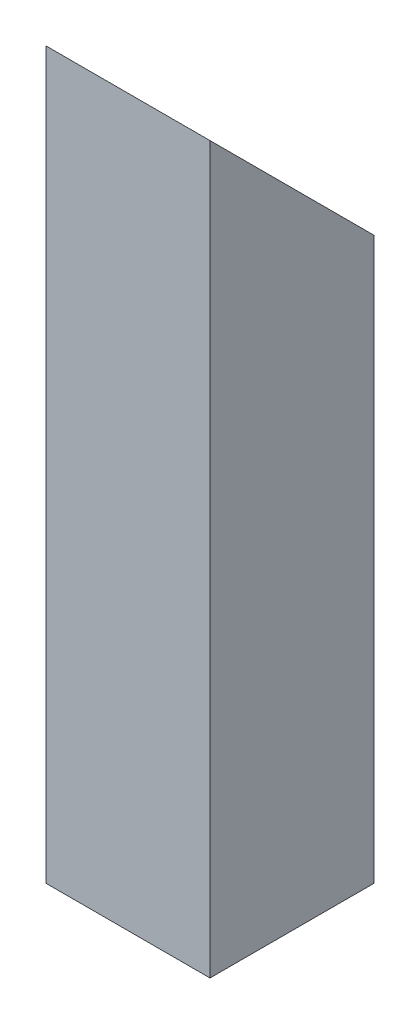
ISO-10303-21;
HEADER;
FILE_DESCRIPTION(('STEP AP214'),'2;1');
FILE_NAME('part.step','',(''),(''),'','','');
FILE_SCHEMA(('AUTOMOTIVE_DESIGN { 1 0 10303 214 1 1 1 1 }'));
ENDSEC;
DATA;
#1=APPLICATION_CONTEXT('core data for automotive mechanical design processes');
#2=APPLICATION_PROTOCOL_DEFINITION('international standard','automotive_design',2000,#1);
#3=PRODUCT_CONTEXT('',#1,'mechanical');
#4=PRODUCT('Part','Part','',(#3));
#5=PRODUCT_RELATED_PRODUCT_CATEGORY('part','',(#4));
#6=PRODUCT_DEFINITION_FORMATION('','',#4);
#7=PRODUCT_DEFINITION_CONTEXT('part definition',#1,'design');
#8=PRODUCT_DEFINITION('design','',#6,#7);
#9=PRODUCT_DEFINITION_SHAPE('','',#8);
#10=(LENGTH_UNIT() NAMED_UNIT(*) SI_UNIT(.MILLI.,.METRE.));
#11=(NAMED_UNIT(*) PLANE_ANGLE_UNIT() SI_UNIT($,.RADIAN.));
#12=(NAMED_UNIT(*) SI_UNIT($,.STERADIAN.) SOLID_ANGLE_UNIT());
#13=UNCERTAINTY_MEASURE_WITH_UNIT(LENGTH_MEASURE(1.E-05),#10,'distance_accuracy_value','');
#14=(GEOMETRIC_REPRESENTATION_CONTEXT(3) GLOBAL_UNCERTAINTY_ASSIGNED_CONTEXT((#13)) GLOBAL_UNIT_ASSIGNED_CONTEXT((#10,
#11,#12)) REPRESENTATION_CONTEXT('',''));
#15=CARTESIAN_POINT('',(0.,0.,0.));
#16=DIRECTION('',(0.,0.,1.));
#17=DIRECTION('',(1.,0.,0.));
#18=AXIS2_PLACEMENT_3D('',#15,#16,#17);
#19=CARTESIAN_POINT('',(44.45,0.,-44.45));
#20=DIRECTION('',(0.,0.,-1.));
#21=DIRECTION('',(-1.,0.,0.));
#22=AXIS2_PLACEMENT_3D('',#19,#20,#21);
#23=PLANE('',#22);
#24=DIRECTION('',(0.,1.,0.));
#25=VECTOR('',#24,1.);
#26=CARTESIAN_POINT('',(0.,0.,-44.45));
#27=LINE('',#26,#25);
#28=CARTESIAN_POINT('',(0.,152.4,-44.45));
#29=VERTEX_POINT('',#28);
#30=CARTESIAN_POINT('',(0.,0.,-44.45));
#31=VERTEX_POINT('',#30);
#32=EDGE_CURVE('E89',#29,#31,#27,.F.);
#33=ORIENTED_EDGE('',*,*,#32,.F.);
#34=DIRECTION('',(1.,0.,0.));
#35=VECTOR('',#34,1.);
#36=CARTESIAN_POINT('',(22.225,152.4,-44.45));
#37=LINE('',#36,#35);
#38=CARTESIAN_POINT('',(44.45,152.4,-44.45));
#39=VERTEX_POINT('',#38);
#40=EDGE_CURVE('E134',#39,#29,#37,.F.);
#41=ORIENTED_EDGE('',*,*,#40,.F.);
#42=DIRECTION('',(0.,1.,0.));
#43=VECTOR('',#42,1.);
#44=CARTESIAN_POINT('',(44.45,0.,-44.45));
#45=LINE('',#44,#43);
#46=CARTESIAN_POINT('',(44.45,0.,-44.45));
#47=VERTEX_POINT('',#46);
#48=EDGE_CURVE('E141',#47,#39,#45,.T.);
#49=ORIENTED_EDGE('',*,*,#48,.F.);
#50=DIRECTION('',(1.,0.,0.));
#51=VECTOR('',#50,1.);
#52=CARTESIAN_POINT('',(0.,0.,-44.45));
#53=LINE('',#52,#51);
#54=EDGE_CURVE('E110',#47,#31,#53,.F.);
#55=ORIENTED_EDGE('',*,*,#54,.T.);
#56=EDGE_LOOP('',(#33,#41,#49,#55));
#57=FACE_BOUND('',#56,.T.);
#58=ADVANCED_FACE('F17',(#57),#23,.T.);
#59=CARTESIAN_POINT('',(41.275,0.,-41.275));
#60=DIRECTION('',(-1.,0.,0.));
#61=DIRECTION('',(0.,0.,1.));
#62=AXIS2_PLACEMENT_3D('',#59,#60,#61);
#63=PLANE('',#62);
#64=DIRECTION('',(0.,1.,0.));
#65=VECTOR('',#64,1.);
#66=CARTESIAN_POINT('',(41.275,0.,-3.175));
#67=LINE('',#66,#65);
#68=CARTESIAN_POINT('',(41.275,193.675,-3.17499999999998));
#69=VERTEX_POINT('',#68);
#70=CARTESIAN_POINT('',(41.275,0.,-3.175));
#71=VERTEX_POINT('',#70);
#72=EDGE_CURVE('E20',#69,#71,#67,.F.);
#73=ORIENTED_EDGE('',*,*,#72,.F.);
#74=DIRECTION('',(0.,0.707106781186548,0.707106781186548));
#75=VECTOR('',#74,1.);
#76=CARTESIAN_POINT('',(41.275,174.625,-22.225));
#77=LINE('',#76,#75);
#78=CARTESIAN_POINT('',(41.275,155.575,-41.275));
#79=VERTEX_POINT('',#78);
#80=EDGE_CURVE('E85',#79,#69,#77,.T.);
#81=ORIENTED_EDGE('',*,*,#80,.F.);
#82=DIRECTION('',(0.,1.,0.));
#83=VECTOR('',#82,1.);
#84=CARTESIAN_POINT('',(41.275,0.,-41.275));
#85=LINE('',#84,#83);
#86=CARTESIAN_POINT('',(41.275,0.,-41.275));
#87=VERTEX_POINT('',#86);
#88=EDGE_CURVE('E78',#87,#79,#85,.T.);
#89=ORIENTED_EDGE('',*,*,#88,.F.);
#90=DIRECTION('',(0.,0.,1.));
#91=VECTOR('',#90,1.);
#92=CARTESIAN_POINT('',(41.275,0.,0.));
#93=LINE('',#92,#91);
#94=EDGE_CURVE('E82',#87,#71,#93,.T.);
#95=ORIENTED_EDGE('',*,*,#94,.T.);
#96=EDGE_LOOP('',(#73,#81,#89,#95));
#97=FACE_BOUND('',#96,.T.);
#98=ADVANCED_FACE('F80',(#97),#63,.T.);
#99=CARTESIAN_POINT('',(41.275,0.,-3.175));
#100=DIRECTION('',(0.,0.,-1.));
#101=DIRECTION('',(-1.,0.,0.));
#102=AXIS2_PLACEMENT_3D('',#99,#100,#101);
#103=PLANE('',#102);
#104=DIRECTION('',(0.,1.,0.));
#105=VECTOR('',#104,1.);
#106=CARTESIAN_POINT('',(3.175,0.,-3.175));
#107=LINE('',#106,#105);
#108=CARTESIAN_POINT('',(3.175,193.675,-3.17499999999999));
#109=VERTEX_POINT('',#108);
#110=CARTESIAN_POINT('',(3.175,0.,-3.175));
#111=VERTEX_POINT('',#110);
#112=EDGE_CURVE('E115',#109,#111,#107,.F.);
#113=ORIENTED_EDGE('',*,*,#112,.F.);
#114=DIRECTION('',(1.,0.,0.));
#115=VECTOR('',#114,1.);
#116=CARTESIAN_POINT('',(22.225,193.675,-3.17500000000001));
#117=LINE('',#116,#115);
#118=EDGE_CURVE('E123',#69,#109,#117,.F.);
#119=ORIENTED_EDGE('',*,*,#118,.F.);
#120=ORIENTED_EDGE('',*,*,#72,.T.);
#121=DIRECTION('',(1.,0.,0.));
#122=VECTOR('',#121,1.);
#123=CARTESIAN_POINT('',(0.,0.,-3.175));
#124=LINE('',#123,#122);
#125=EDGE_CURVE('E103',#71,#111,#124,.F.);
#126=ORIENTED_EDGE('',*,*,#125,.T.);
#127=EDGE_LOOP('',(#113,#119,#120,#126));
#128=FACE_BOUND('',#127,.T.);
#129=ADVANCED_FACE('F121',(#128),#103,.T.);
#130=CARTESIAN_POINT('',(3.175,0.,-3.175));
#131=DIRECTION('',(1.,0.,0.));
#132=DIRECTION('',(0.,0.,-1.));
#133=AXIS2_PLACEMENT_3D('',#130,#131,#132);
#134=PLANE('',#133);
#135=DIRECTION('',(0.,1.,0.));
#136=VECTOR('',#135,1.);
#137=CARTESIAN_POINT('',(3.175,0.,-41.275));
#138=LINE('',#137,#136);
#139=CARTESIAN_POINT('',(3.175,155.575,-41.275));
#140=VERTEX_POINT('',#139);
#141=CARTESIAN_POINT('',(3.175,0.,-41.275));
#142=VERTEX_POINT('',#141);
#143=EDGE_CURVE('E90',#140,#142,#138,.F.);
#144=ORIENTED_EDGE('',*,*,#143,.F.);
#145=DIRECTION('',(0.,0.707106781186548,0.707106781186548));
#146=VECTOR('',#145,1.);
#147=CARTESIAN_POINT('',(3.17499999999999,174.625,-22.225));
#148=LINE('',#147,#146);
#149=EDGE_CURVE('E126',#109,#140,#148,.F.);
#150=ORIENTED_EDGE('',*,*,#149,.F.);
#151=ORIENTED_EDGE('',*,*,#112,.T.);
#152=DIRECTION('',(0.,0.,1.));
#153=VECTOR('',#152,1.);
#154=CARTESIAN_POINT('',(3.175,0.,0.));
#155=LINE('',#154,#153);
#156=EDGE_CURVE('E105',#111,#142,#155,.F.);
#157=ORIENTED_EDGE('',*,*,#156,.T.);
#158=EDGE_LOOP('',(#144,#150,#151,#157));
#159=FACE_BOUND('',#158,.T.);
#160=ADVANCED_FACE('F145',(#159),#134,.T.);
#161=CARTESIAN_POINT('',(3.175,0.,-41.275));
#162=DIRECTION('',(0.,0.,1.));
#163=DIRECTION('',(1.,0.,0.));
#164=AXIS2_PLACEMENT_3D('',#161,#162,#163);
#165=PLANE('',#164);
#166=ORIENTED_EDGE('',*,*,#88,.T.);
#167=DIRECTION('',(1.,0.,0.));
#168=VECTOR('',#167,1.);
#169=CARTESIAN_POINT('',(22.225,155.575,-41.275));
#170=LINE('',#169,#168);
#171=EDGE_CURVE('E130',#140,#79,#170,.T.);
#172=ORIENTED_EDGE('',*,*,#171,.F.);
#173=ORIENTED_EDGE('',*,*,#143,.T.);
#174=DIRECTION('',(1.,0.,0.));
#175=VECTOR('',#174,1.);
#176=CARTESIAN_POINT('',(0.,0.,-41.275));
#177=LINE('',#176,#175);
#178=EDGE_CURVE('E93',#142,#87,#177,.T.);
#179=ORIENTED_EDGE('',*,*,#178,.T.);
#180=EDGE_LOOP('',(#166,#172,#173,#179));
#181=FACE_BOUND('',#180,.T.);
#182=ADVANCED_FACE('F94',(#181),#165,.T.);
#183=CARTESIAN_POINT('',(0.,0.,-44.45));
#184=DIRECTION('',(-1.,0.,0.));
#185=DIRECTION('',(0.,0.,1.));
#186=AXIS2_PLACEMENT_3D('',#183,#184,#185);
#187=PLANE('',#186);
#188=DIRECTION('',(0.,1.,0.));
#189=VECTOR('',#188,1.);
#190=CARTESIAN_POINT('',(0.,0.,0.));
#191=LINE('',#190,#189);
#192=CARTESIAN_POINT('',(0.,196.85,0.));
#193=VERTEX_POINT('',#192);
#194=CARTESIAN_POINT('',(0.,0.,0.));
#195=VERTEX_POINT('',#194);
#196=EDGE_CURVE('E146',#193,#195,#191,.F.);
#197=ORIENTED_EDGE('',*,*,#196,.F.);
#198=DIRECTION('',(0.,0.707106781186548,0.707106781186548));
#199=VECTOR('',#198,1.);
#200=CARTESIAN_POINT('',(0.,174.625,-22.225));
#201=LINE('',#200,#199);
#202=EDGE_CURVE('E131',#29,#193,#201,.T.);
#203=ORIENTED_EDGE('',*,*,#202,.F.);
#204=ORIENTED_EDGE('',*,*,#32,.T.);
#205=DIRECTION('',(0.,0.,1.));
#206=VECTOR('',#205,1.);
#207=CARTESIAN_POINT('',(0.,0.,0.));
#208=LINE('',#207,#206);
#209=EDGE_CURVE('E98',#31,#195,#208,.T.);
#210=ORIENTED_EDGE('',*,*,#209,.T.);
#211=EDGE_LOOP('',(#197,#203,#204,#210));
#212=FACE_BOUND('',#211,.T.);
#213=ADVANCED_FACE('F165',(#212),#187,.T.);
#214=CARTESIAN_POINT('',(0.,0.,0.));
#215=DIRECTION('',(0.,1.,0.));
#216=DIRECTION('',(0.,0.,1.));
#217=AXIS2_PLACEMENT_3D('',#214,#215,#216);
#218=PLANE('',#217);
#219=ORIENTED_EDGE('',*,*,#125,.F.);
#220=ORIENTED_EDGE('',*,*,#94,.F.);
#221=ORIENTED_EDGE('',*,*,#178,.F.);
#222=ORIENTED_EDGE('',*,*,#156,.F.);
#223=EDGE_LOOP('',(#219,#220,#221,#222));
#224=FACE_BOUND('',#223,.T.);
#225=ORIENTED_EDGE('',*,*,#54,.F.);
#226=DIRECTION('',(0.,0.,-1.));
#227=VECTOR('',#226,1.);
#228=CARTESIAN_POINT('',(44.45,0.,0.));
#229=LINE('',#228,#227);
#230=CARTESIAN_POINT('',(44.45,0.,0.));
#231=VERTEX_POINT('',#230);
#232=EDGE_CURVE('E143',#231,#47,#229,.T.);
#233=ORIENTED_EDGE('',*,*,#232,.F.);
#234=DIRECTION('',(1.,0.,0.));
#235=VECTOR('',#234,1.);
#236=CARTESIAN_POINT('',(0.,0.,0.));
#237=LINE('',#236,#235);
#238=EDGE_CURVE('E151',#195,#231,#237,.T.);
#239=ORIENTED_EDGE('',*,*,#238,.F.);
#240=ORIENTED_EDGE('',*,*,#209,.F.);
#241=EDGE_LOOP('',(#225,#233,#239,#240));
#242=FACE_BOUND('',#241,.T.);
#243=ADVANCED_FACE('F101',(#224,#242),#218,.F.);
#244=CARTESIAN_POINT('',(44.45,0.,0.));
#245=DIRECTION('',(1.,0.,0.));
#246=DIRECTION('',(0.,0.,-1.));
#247=AXIS2_PLACEMENT_3D('',#244,#245,#246);
#248=PLANE('',#247);
#249=ORIENTED_EDGE('',*,*,#48,.T.);
#250=DIRECTION('',(0.,0.707106781186548,0.707106781186548));
#251=VECTOR('',#250,1.);
#252=CARTESIAN_POINT('',(44.45,174.625,-22.225));
#253=LINE('',#252,#251);
#254=CARTESIAN_POINT('',(44.45,196.85,0.));
#255=VERTEX_POINT('',#254);
#256=EDGE_CURVE('E35',#255,#39,#253,.F.);
#257=ORIENTED_EDGE('',*,*,#256,.F.);
#258=DIRECTION('',(0.,1.,0.));
#259=VECTOR('',#258,1.);
#260=CARTESIAN_POINT('',(44.45,0.,0.));
#261=LINE('',#260,#259);
#262=EDGE_CURVE('E26',#231,#255,#261,.T.);
#263=ORIENTED_EDGE('',*,*,#262,.F.);
#264=ORIENTED_EDGE('',*,*,#232,.T.);
#265=EDGE_LOOP('',(#249,#257,#263,#264));
#266=FACE_BOUND('',#265,.T.);
#267=ADVANCED_FACE('F158',(#266),#248,.T.);
#268=CARTESIAN_POINT('',(22.225,174.625,-22.225));
#269=DIRECTION('',(0.,0.707106781186548,-0.707106781186548));
#270=DIRECTION('',(0.,0.707106781186548,0.707106781186548));
#271=AXIS2_PLACEMENT_3D('',#268,#269,#270);
#272=PLANE('',#271);
#273=ORIENTED_EDGE('',*,*,#149,.T.);
#274=ORIENTED_EDGE('',*,*,#171,.T.);
#275=ORIENTED_EDGE('',*,*,#80,.T.);
#276=ORIENTED_EDGE('',*,*,#118,.T.);
#277=EDGE_LOOP('',(#273,#274,#275,#276));
#278=FACE_BOUND('',#277,.T.);
#279=ORIENTED_EDGE('',*,*,#40,.T.);
#280=ORIENTED_EDGE('',*,*,#202,.T.);
#281=DIRECTION('',(1.,0.,0.));
#282=VECTOR('',#281,1.);
#283=CARTESIAN_POINT('',(0.,196.85,0.));
#284=LINE('',#283,#282);
#285=EDGE_CURVE('E11',#255,#193,#284,.F.);
#286=ORIENTED_EDGE('',*,*,#285,.F.);
#287=ORIENTED_EDGE('',*,*,#256,.T.);
#288=EDGE_LOOP('',(#279,#280,#286,#287));
#289=FACE_BOUND('',#288,.T.);
#290=ADVANCED_FACE('F128',(#278,#289),#272,.T.);
#291=CARTESIAN_POINT('',(0.,0.,0.));
#292=DIRECTION('',(0.,0.,1.));
#293=DIRECTION('',(1.,0.,0.));
#294=AXIS2_PLACEMENT_3D('',#291,#292,#293);
#295=PLANE('',#294);
#296=ORIENTED_EDGE('',*,*,#262,.T.);
#297=ORIENTED_EDGE('',*,*,#285,.T.);
#298=ORIENTED_EDGE('',*,*,#196,.T.);
#299=ORIENTED_EDGE('',*,*,#238,.T.);
#300=EDGE_LOOP('',(#296,#297,#298,#299));
#301=FACE_BOUND('',#300,.T.);
#302=ADVANCED_FACE('F156',(#301),#295,.T.);
#303=CLOSED_SHELL('',(#58,#98,#129,#160,#182,#213,#243,#267,#290,#302));
#304=MANIFOLD_SOLID_BREP('B1',#303);
#305=ADVANCED_BREP_SHAPE_REPRESENTATION('',(#18,#304),#14);
#306=SHAPE_DEFINITION_REPRESENTATION(#9,#305);
ENDSEC;
END-ISO-10303-21;
